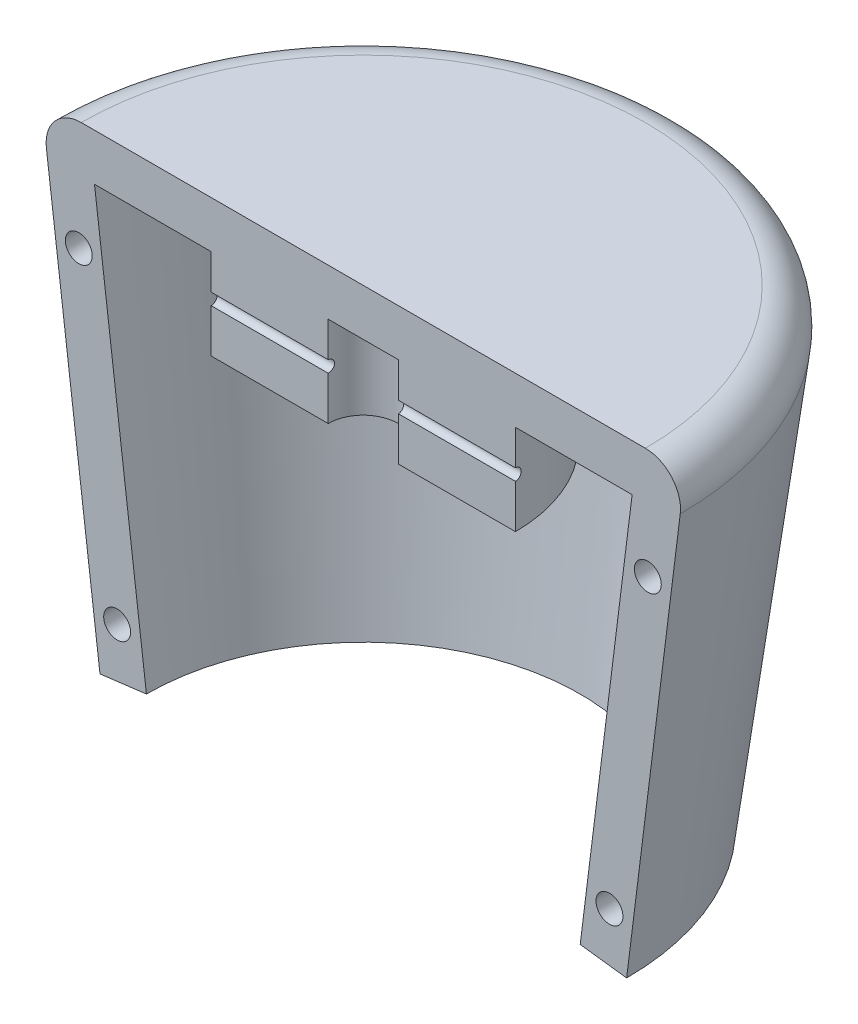
ISO-10303-21;
HEADER;
FILE_DESCRIPTION(('STEP AP214'),'2;1');
FILE_NAME('part.step','',(''),(''),'','','');
FILE_SCHEMA(('AUTOMOTIVE_DESIGN { 1 0 10303 214 1 1 1 1 }'));
ENDSEC;
DATA;
#1=APPLICATION_CONTEXT('core data for automotive mechanical design processes');
#2=APPLICATION_PROTOCOL_DEFINITION('international standard','automotive_design',2000,#1);
#3=PRODUCT_CONTEXT('',#1,'mechanical');
#4=PRODUCT('Part','Part','',(#3));
#5=PRODUCT_RELATED_PRODUCT_CATEGORY('part','',(#4));
#6=PRODUCT_DEFINITION_FORMATION('','',#4);
#7=PRODUCT_DEFINITION_CONTEXT('part definition',#1,'design');
#8=PRODUCT_DEFINITION('design','',#6,#7);
#9=PRODUCT_DEFINITION_SHAPE('','',#8);
#10=(LENGTH_UNIT() NAMED_UNIT(*) SI_UNIT(.MILLI.,.METRE.));
#11=(NAMED_UNIT(*) PLANE_ANGLE_UNIT() SI_UNIT($,.RADIAN.));
#12=(NAMED_UNIT(*) SI_UNIT($,.STERADIAN.) SOLID_ANGLE_UNIT());
#13=UNCERTAINTY_MEASURE_WITH_UNIT(LENGTH_MEASURE(1.E-05),#10,'distance_accuracy_value','');
#14=(GEOMETRIC_REPRESENTATION_CONTEXT(3) GLOBAL_UNCERTAINTY_ASSIGNED_CONTEXT((#13)) GLOBAL_UNIT_ASSIGNED_CONTEXT((#10,
#11,#12)) REPRESENTATION_CONTEXT('',''));
#15=CARTESIAN_POINT('',(0.,0.,0.));
#16=DIRECTION('',(0.,0.,1.));
#17=DIRECTION('',(1.,0.,0.));
#18=AXIS2_PLACEMENT_3D('',#15,#16,#17);
#19=CARTESIAN_POINT('',(0.,40.,0.));
#20=DIRECTION('',(0.,1.,0.));
#21=DIRECTION('',(-1.,0.,0.));
#22=AXIS2_PLACEMENT_3D('',#19,#20,#21);
#23=CYLINDRICAL_SURFACE('',#22,3.);
#24=DIRECTION('',(0.,1.,0.));
#25=VECTOR('',#24,1.);
#26=CARTESIAN_POINT('',(-3.,36.,0.));
#27=LINE('',#26,#25);
#28=CARTESIAN_POINT('',(-3.,33.,0.));
#29=VERTEX_POINT('',#28);
#30=CARTESIAN_POINT('',(-3.,36.,0.));
#31=VERTEX_POINT('',#30);
#32=EDGE_CURVE('E151',#29,#31,#27,.T.);
#33=ORIENTED_EDGE('',*,*,#32,.F.);
#34=CARTESIAN_POINT('',(-3.,33.,0.));
#35=CARTESIAN_POINT('',(-3.0000147639304,33.0000248009824,-0.0279245639136445));
#36=CARTESIAN_POINT('',(-2.99961054875443,32.9976622414982,-0.0558377564918865));
#37=CARTESIAN_POINT('',(-2.99807410355357,32.9883505080388,-0.110832206753165));
#38=CARTESIAN_POINT('',(-2.9969428177627,32.9814072825856,-0.137914495790226));
#39=CARTESIAN_POINT('',(-2.99406131473217,32.9631193253892,-0.190520410616297));
#40=CARTESIAN_POINT('',(-2.99231095459141,32.9517735773517,-0.216043674938698));
#41=CARTESIAN_POINT('',(-2.9883884234628,32.9250188992578,-0.264825281196731));
#42=CARTESIAN_POINT('',(-2.98621624998891,32.9096099452539,-0.288083609782283));
#43=CARTESIAN_POINT('',(-2.98166682330032,32.8750099483992,-0.331893550581972));
#44=CARTESIAN_POINT('',(-2.97928799262738,32.8557880548106,-0.352420637095487));
#45=CARTESIAN_POINT('',(-2.9746054532048,32.8141725142409,-0.389976046582249));
#46=CARTESIAN_POINT('',(-2.97230175642609,32.7917783648384,-0.407003814285053));
#47=CARTESIAN_POINT('',(-2.96801507546756,32.7442851314407,-0.437173866317822));
#48=CARTESIAN_POINT('',(-2.96603414615731,32.7191702914344,-0.450291665381797));
#49=CARTESIAN_POINT('',(-2.96263949656778,32.6670565338948,-0.472112172118848));
#50=CARTESIAN_POINT('',(-2.96122570552704,32.640057851901,-0.48081543062723));
#51=CARTESIAN_POINT('',(-2.95914108655384,32.5852042725034,-0.493482800364945));
#52=CARTESIAN_POINT('',(-2.95846355313407,32.5573595183764,-0.497489710534991));
#53=CARTESIAN_POINT('',(-2.95790787498487,32.5013846162036,-0.500783361656072));
#54=CARTESIAN_POINT('',(-2.95802969270745,32.4732544816248,-0.500070324317516));
#55=CARTESIAN_POINT('',(-2.95905285943334,32.417814339119,-0.493979010226865));
#56=CARTESIAN_POINT('',(-2.95994615267881,32.390498864018,-0.488648942843718));
#57=CARTESIAN_POINT('',(-2.96239900004534,32.3371555707913,-0.473550565119978));
#58=CARTESIAN_POINT('',(-2.96395857277451,32.3111277886513,-0.463782130822525));
#59=CARTESIAN_POINT('',(-2.9675769935558,32.2609537650134,-0.440035229974666));
#60=CARTESIAN_POINT('',(-2.96963821515902,32.23681721166,-0.426036670162596));
#61=CARTESIAN_POINT('',(-2.97402591987438,32.191218323299,-0.394241728150705));
#62=CARTESIAN_POINT('',(-2.97635241452118,32.1697561046624,-0.376445180776667));
#63=CARTESIAN_POINT('',(-2.9810437450182,32.1298375284587,-0.337299196931076));
#64=CARTESIAN_POINT('',(-2.98340870102549,32.1114212894615,-0.315908841019962));
#65=CARTESIAN_POINT('',(-2.98788456267353,32.0784285752277,-0.270313606709418));
#66=CARTESIAN_POINT('',(-2.98999539649458,32.0638531841095,-0.24610793643186));
#67=CARTESIAN_POINT('',(-2.99372931333068,32.0389504033863,-0.19552381086372));
#68=CARTESIAN_POINT('',(-2.99535170568755,32.0286290214337,-0.169142345470613));
#69=CARTESIAN_POINT('',(-2.99791557548819,32.012594314861,-0.115018377774364));
#70=CARTESIAN_POINT('',(-2.99885806696339,32.0068741263644,-0.0872779685237835));
#71=CARTESIAN_POINT('',(-2.99980530629215,32.0011729031573,-0.039594787009645));
#72=CARTESIAN_POINT('',(-3.00000587638439,31.9999891322544,-0.019793444655969));
#73=CARTESIAN_POINT('',(-3.,32.,0.));
#74=B_SPLINE_CURVE_WITH_KNOTS('',3,(#34,#35,#36,#37,#38,#39,#40,#41,#42,#43,#44,#45,#46,#47,#48,
#49,#50,#51,#52,#53,#54,#55,#56,#57,#58,#59,#60,#61,#62,#63,#64,#65,#66,#67,#68,#69,#70,#71,#72,
#73),.UNSPECIFIED.,.F.,.F.,(4,2,2,2,2,2,2,2,2,2,2,2,2,2,2,2,2,2,2,4),(0.,0.083653964100156,
0.167199507173348,0.250764347685629,0.334329680719544,0.418600958696159,0.502885598496283,
0.587687467227782,0.672478751990046,0.756491152577018,0.840499606871928,0.923641306490468,
1.00678532827338,1.09033066685202,1.17387963955236,1.25845388716987,1.34305198121945,
1.42776914147558,1.51235968845851,1.57172612554727),.UNSPECIFIED.);
#75=CARTESIAN_POINT('',(-3.,32.,0.));
#76=VERTEX_POINT('',#75);
#77=EDGE_CURVE('E139',#29,#76,#74,.T.);
#78=ORIENTED_EDGE('',*,*,#77,.T.);
#79=CARTESIAN_POINT('',(-3.,28.277027027027,0.));
#80=VERTEX_POINT('',#79);
#81=EDGE_CURVE('E149',#80,#76,#27,.T.);
#82=ORIENTED_EDGE('',*,*,#81,.F.);
#83=CARTESIAN_POINT('',(0.,28.277027027027,0.));
#84=DIRECTION('',(0.,1.,0.));
#85=DIRECTION('',(-1.,0.,0.));
#86=AXIS2_PLACEMENT_3D('',#83,#84,#85);
#87=CIRCLE('',#86,3.);
#88=CARTESIAN_POINT('',(3.,28.277027027027,0.));
#89=VERTEX_POINT('',#88);
#90=EDGE_CURVE('E219',#89,#80,#87,.T.);
#91=ORIENTED_EDGE('',*,*,#90,.F.);
#92=DIRECTION('',(0.,1.,0.));
#93=VECTOR('',#92,1.);
#94=CARTESIAN_POINT('',(3.,36.,0.));
#95=LINE('',#94,#93);
#96=CARTESIAN_POINT('',(3.,32.,0.));
#97=VERTEX_POINT('',#96);
#98=EDGE_CURVE('E194',#89,#97,#95,.T.);
#99=ORIENTED_EDGE('',*,*,#98,.T.);
#100=CARTESIAN_POINT('',(3.,32.,0.));
#101=CARTESIAN_POINT('',(3.0000147639304,31.9999751990176,-0.0279245639136241));
#102=CARTESIAN_POINT('',(2.99961054875443,32.0023377585018,-0.0558377564918663));
#103=CARTESIAN_POINT('',(2.99807410355357,32.0116494919612,-0.110832206753146));
#104=CARTESIAN_POINT('',(2.99694281776271,32.0185927174144,-0.137914495790207));
#105=CARTESIAN_POINT('',(2.99406131473217,32.0368806746108,-0.190520410616279));
#106=CARTESIAN_POINT('',(2.99231095459141,32.0482264226483,-0.216043674938679));
#107=CARTESIAN_POINT('',(2.98838842346281,32.0749811007422,-0.264825281196716));
#108=CARTESIAN_POINT('',(2.98621624998892,32.0903900547461,-0.288083609782271));
#109=CARTESIAN_POINT('',(2.98166682330033,32.1249900516008,-0.331893550581961));
#110=CARTESIAN_POINT('',(2.97928799262738,32.1442119451894,-0.352420637095474));
#111=CARTESIAN_POINT('',(2.9746054532048,32.1858274857591,-0.389976046582236));
#112=CARTESIAN_POINT('',(2.97230175642609,32.2082216351616,-0.407003814285042));
#113=CARTESIAN_POINT('',(2.96801507546756,32.2557148685593,-0.437173866317814));
#114=CARTESIAN_POINT('',(2.96603414615731,32.2808297085656,-0.450291665381789));
#115=CARTESIAN_POINT('',(2.96263949656779,32.3329434661052,-0.472112172118842));
#116=CARTESIAN_POINT('',(2.96122570552704,32.3599421480989,-0.480815430627225));
#117=CARTESIAN_POINT('',(2.95914108655384,32.4147957274966,-0.493482800364942));
#118=CARTESIAN_POINT('',(2.95846355313408,32.4426404816235,-0.497489710534988));
#119=CARTESIAN_POINT('',(2.95790787498487,32.4986153837964,-0.500783361656072));
#120=CARTESIAN_POINT('',(2.95802969270746,32.5267455183752,-0.500070324317517));
#121=CARTESIAN_POINT('',(2.95905285943334,32.582185660881,-0.493979010226869));
#122=CARTESIAN_POINT('',(2.95994615267881,32.609501135982,-0.488648942843724));
#123=CARTESIAN_POINT('',(2.96239900004534,32.6628444292087,-0.473550565119986));
#124=CARTESIAN_POINT('',(2.96395857277451,32.6888722113487,-0.463782130822533));
#125=CARTESIAN_POINT('',(2.96757699355581,32.7390462349866,-0.440035229974674));
#126=CARTESIAN_POINT('',(2.96963821515902,32.76318278834,-0.426036670162605));
#127=CARTESIAN_POINT('',(2.97402591987438,32.808781676701,-0.394241728150716));
#128=CARTESIAN_POINT('',(2.97635241452118,32.8302438953376,-0.376445180776679));
#129=CARTESIAN_POINT('',(2.9810437450182,32.8701624715412,-0.33729919693109));
#130=CARTESIAN_POINT('',(2.98340870102549,32.8885787105385,-0.315908841019978));
#131=CARTESIAN_POINT('',(2.98788456267353,32.9215714247723,-0.270313606709434));
#132=CARTESIAN_POINT('',(2.98999539649458,32.9361468158905,-0.246107936431875));
#133=CARTESIAN_POINT('',(2.99372931333068,32.9610495966137,-0.195523810863735));
#134=CARTESIAN_POINT('',(2.99535170568755,32.9713709785663,-0.16914234547063));
#135=CARTESIAN_POINT('',(2.99791557548819,32.987405685139,-0.115018377774382));
#136=CARTESIAN_POINT('',(2.99885806696339,32.9931258736356,-0.0872779685238021));
#137=CARTESIAN_POINT('',(2.99980530629215,32.9988270968427,-0.039594787009651));
#138=CARTESIAN_POINT('',(3.0000058763844,33.0000108677456,-0.019793444655962));
#139=CARTESIAN_POINT('',(3.,33.,0.));
#140=B_SPLINE_CURVE_WITH_KNOTS('',3,(#100,#101,#102,#103,#104,#105,#106,#107,#108,#109,#110,
#111,#112,#113,#114,#115,#116,#117,#118,#119,#120,#121,#122,#123,#124,#125,#126,#127,#128,#129,
#130,#131,#132,#133,#134,#135,#136,#137,#138,#139),.UNSPECIFIED.,.F.,.F.,(4,2,2,2,2,2,2,2,2,2,2,
2,2,2,2,2,2,2,2,4),(0.,0.0836539641001557,0.167199507173349,0.250764347685631,0.334329680719548,
0.418600958696167,0.502885598496286,0.587687467227787,0.672478751990045,0.756491152577018,
0.840499606871927,0.92364130649046,1.00678532827338,1.09033066685202,1.17387963955236,
1.25845388716987,1.34305198121945,1.42776914147558,1.51235968845851,1.57172612554731),.UNSPECIFIED.);
#141=CARTESIAN_POINT('',(3.,33.,0.));
#142=VERTEX_POINT('',#141);
#143=EDGE_CURVE('E59',#97,#142,#140,.T.);
#144=ORIENTED_EDGE('',*,*,#143,.T.);
#145=CARTESIAN_POINT('',(3.,36.,0.));
#146=VERTEX_POINT('',#145);
#147=EDGE_CURVE('E193',#142,#146,#95,.T.);
#148=ORIENTED_EDGE('',*,*,#147,.T.);
#149=CARTESIAN_POINT('',(0.,36.,0.));
#150=DIRECTION('',(0.,1.,0.));
#151=DIRECTION('',(-1.,0.,0.));
#152=AXIS2_PLACEMENT_3D('',#149,#150,#151);
#153=CIRCLE('',#152,3.);
#154=EDGE_CURVE('E222',#146,#31,#153,.T.);
#155=ORIENTED_EDGE('',*,*,#154,.T.);
#156=EDGE_LOOP('',(#33,#78,#82,#91,#99,#144,#148,#155));
#157=FACE_BOUND('',#156,.T.);
#158=ADVANCED_FACE('F43',(#157),#23,.F.);
#159=CARTESIAN_POINT('',(0.,40.,0.));
#160=DIRECTION('',(0.,1.,0.));
#161=DIRECTION('',(-1.,0.,0.));
#162=AXIS2_PLACEMENT_3D('',#159,#160,#161);
#163=CYLINDRICAL_SURFACE('',#162,13.);
#164=DIRECTION('',(0.,-1.,0.));
#165=VECTOR('',#164,1.);
#166=CARTESIAN_POINT('',(-13.,28.277027027027,0.));
#167=LINE('',#166,#165);
#168=CARTESIAN_POINT('',(-13.,32.,0.));
#169=VERTEX_POINT('',#168);
#170=CARTESIAN_POINT('',(-13.,28.277027027027,0.));
#171=VERTEX_POINT('',#170);
#172=EDGE_CURVE('E273',#169,#171,#167,.T.);
#173=ORIENTED_EDGE('',*,*,#172,.F.);
#174=CARTESIAN_POINT('',(-13.,32.,0.));
#175=CARTESIAN_POINT('',(-13.0000035132119,31.9999760642147,-0.0281174552121379));
#176=CARTESIAN_POINT('',(-12.9999088766393,32.0023703375464,-0.0562275432370705));
#177=CARTESIAN_POINT('',(-12.9995492608419,32.0118186194758,-0.111631319852076));
#178=CARTESIAN_POINT('',(-12.9992844115316,32.0188690743658,-0.138925614481822));
#179=CARTESIAN_POINT('',(-12.9986101016094,32.0374577240236,-0.191953351720072));
#180=CARTESIAN_POINT('',(-12.9982005757836,32.048997942816,-0.21768608430616));
#181=CARTESIAN_POINT('',(-12.9972842239831,32.0762278173729,-0.266844646969351));
#182=CARTESIAN_POINT('',(-12.9967774160351,32.091916704573,-0.29027090323226));
#183=CARTESIAN_POINT('',(-12.9957229355148,32.1270106201056,-0.334169226927111));
#184=CARTESIAN_POINT('',(-12.995175243362,32.1464174361039,-0.354639864892575));
#185=CARTESIAN_POINT('',(-12.9941008987482,32.1883950786375,-0.392036510430603));
#186=CARTESIAN_POINT('',(-12.9935742495031,32.210966386449,-0.408961977852564));
#187=CARTESIAN_POINT('',(-12.9926013007152,32.2586377931233,-0.438788146729855));
#188=CARTESIAN_POINT('',(-12.9921550226534,32.283738565257,-0.45168777285846));
#189=CARTESIAN_POINT('',(-12.9913934069437,32.3357499474249,-0.473088420619371));
#190=CARTESIAN_POINT('',(-12.9910780605221,32.36266043605,-0.481589736990493));
#191=CARTESIAN_POINT('',(-12.9906140090866,32.4175150872946,-0.493949703342922));
#192=CARTESIAN_POINT('',(-12.9904652240381,32.4454587467901,-0.497810583171391));
#193=CARTESIAN_POINT('',(-12.9903508317234,32.5015986232511,-0.500786972369972));
#194=CARTESIAN_POINT('',(-12.9903852280009,32.5297948450921,-0.499902389934902));
#195=CARTESIAN_POINT('',(-12.9906332513038,32.5856227529954,-0.493414668348014));
#196=CARTESIAN_POINT('',(-12.9908467814915,32.6132547358132,-0.487814078606448));
#197=CARTESIAN_POINT('',(-12.991428849319,32.6671859075582,-0.47205729066416));
#198=CARTESIAN_POINT('',(-12.9917973867406,32.6934850983608,-0.461901098873533));
#199=CARTESIAN_POINT('',(-12.9926480489076,32.7440130144111,-0.437318229985122));
#200=CARTESIAN_POINT('',(-12.9931302070657,32.7682411277506,-0.422890296365473));
#201=CARTESIAN_POINT('',(-12.9941536930643,32.8139311015788,-0.390175196322433));
#202=CARTESIAN_POINT('',(-12.9946950182886,32.8353930842871,-0.371888200503441));
#203=CARTESIAN_POINT('',(-12.9957762040031,32.8749549696929,-0.331962381978058));
#204=CARTESIAN_POINT('',(-12.996316063596,32.8930531363028,-0.310321838990642));
#205=CARTESIAN_POINT('',(-12.9973333289028,32.9253653024465,-0.264300871222812));
#206=CARTESIAN_POINT('',(-12.9978107148502,32.9395780741836,-0.239919583785663));
#207=CARTESIAN_POINT('',(-12.9986494541208,32.9637166267974,-0.18910102659219));
#208=CARTESIAN_POINT('',(-12.9990107350529,32.9736397344073,-0.162662486854808));
#209=CARTESIAN_POINT('',(-12.9995749374342,32.9888866070271,-0.108525730018713));
#210=CARTESIAN_POINT('',(-12.999778100346,32.9942173863339,-0.0808295022723348));
#211=CARTESIAN_POINT('',(-12.9999642771233,32.9990667158957,-0.0353239786092012));
#212=CARTESIAN_POINT('',(-13.000000993749,33.0000076288249,-0.0176573871833034));
#213=CARTESIAN_POINT('',(-13.,33.,0.));
#214=B_SPLINE_CURVE_WITH_KNOTS('',3,(#174,#175,#176,#177,#178,#179,#180,#181,#182,#183,#184,
#185,#186,#187,#188,#189,#190,#191,#192,#193,#194,#195,#196,#197,#198,#199,#200,#201,#202,#203,
#204,#205,#206,#207,#208,#209,#210,#211,#212,#213),.UNSPECIFIED.,.F.,.F.,(4,2,2,2,2,2,2,2,2,2,2,
2,2,2,2,2,2,2,2,4),(0.,0.0842398560442666,0.168415492431489,0.252629119981758,0.336827157397276,
0.421065781236175,0.505317230550608,0.589591164717802,0.67385945080215,0.758087227633119,
0.842316633931098,0.926500536152512,1.01068431992086,1.09489289077559,1.17909773965249,
1.26334592725551,1.34762070684717,1.43194793001396,1.51614612271676,1.56911768803553),.UNSPECIFIED.);
#215=CARTESIAN_POINT('',(-13.,33.,0.));
#216=VERTEX_POINT('',#215);
#217=EDGE_CURVE('E67',#169,#216,#214,.T.);
#218=ORIENTED_EDGE('',*,*,#217,.T.);
#219=CARTESIAN_POINT('',(-13.,36.,0.));
#220=VERTEX_POINT('',#219);
#221=EDGE_CURVE('E274',#220,#216,#167,.T.);
#222=ORIENTED_EDGE('',*,*,#221,.F.);
#223=CARTESIAN_POINT('',(0.,36.,0.));
#224=DIRECTION('',(0.,1.,0.));
#225=DIRECTION('',(-1.,0.,0.));
#226=AXIS2_PLACEMENT_3D('',#223,#224,#225);
#227=CIRCLE('',#226,13.);
#228=CARTESIAN_POINT('',(13.,36.,0.));
#229=VERTEX_POINT('',#228);
#230=EDGE_CURVE('E212',#229,#220,#227,.T.);
#231=ORIENTED_EDGE('',*,*,#230,.F.);
#232=DIRECTION('',(0.,-1.,0.));
#233=VECTOR('',#232,1.);
#234=CARTESIAN_POINT('',(13.,28.277027027027,0.));
#235=LINE('',#234,#233);
#236=CARTESIAN_POINT('',(13.,33.,0.));
#237=VERTEX_POINT('',#236);
#238=EDGE_CURVE('E185',#229,#237,#235,.T.);
#239=ORIENTED_EDGE('',*,*,#238,.T.);
#240=CARTESIAN_POINT('',(13.,33.,0.));
#241=CARTESIAN_POINT('',(13.0000035132119,33.0000239357853,-0.0281174552120494));
#242=CARTESIAN_POINT('',(12.9999088766393,32.9976296624536,-0.0562275432369822));
#243=CARTESIAN_POINT('',(12.9995492608419,32.9881813805242,-0.11163131985199));
#244=CARTESIAN_POINT('',(12.9992844115316,32.9811309256342,-0.138925614481738));
#245=CARTESIAN_POINT('',(12.9986101016094,32.9625422759765,-0.191953351719992));
#246=CARTESIAN_POINT('',(12.9982005757836,32.951002057184,-0.217686084306081));
#247=CARTESIAN_POINT('',(12.9972842239831,32.9237721826272,-0.266844646969277));
#248=CARTESIAN_POINT('',(12.9967774160351,32.9080832954271,-0.29027090323219));
#249=CARTESIAN_POINT('',(12.9957229355148,32.8729893798944,-0.334169226927047));
#250=CARTESIAN_POINT('',(12.9951752433621,32.8535825638962,-0.354639864892515));
#251=CARTESIAN_POINT('',(12.9941008987482,32.8116049213626,-0.39203651043055));
#252=CARTESIAN_POINT('',(12.9935742495032,32.7890336135511,-0.408961977852516));
#253=CARTESIAN_POINT('',(12.9926013007152,32.7413622068768,-0.438788146729814));
#254=CARTESIAN_POINT('',(12.9921550226534,32.7162614347431,-0.451687772858422));
#255=CARTESIAN_POINT('',(12.9913934069437,32.6642500525752,-0.473088420619342));
#256=CARTESIAN_POINT('',(12.9910780605221,32.6373395639501,-0.481589736990469));
#257=CARTESIAN_POINT('',(12.9906140090866,32.5824849127054,-0.493949703342907));
#258=CARTESIAN_POINT('',(12.9904652240381,32.55454125321,-0.497810583171381));
#259=CARTESIAN_POINT('',(12.9903508317234,32.498401376749,-0.500786972369972));
#260=CARTESIAN_POINT('',(12.9903852280009,32.470205154908,-0.499902389934907));
#261=CARTESIAN_POINT('',(12.9906332513038,32.4143772470046,-0.493414668348027));
#262=CARTESIAN_POINT('',(12.9908467814915,32.3867452641869,-0.487814078606465));
#263=CARTESIAN_POINT('',(12.991428849319,32.3328140924419,-0.472057290664185));
#264=CARTESIAN_POINT('',(12.9917973867406,32.3065149016393,-0.461901098873561));
#265=CARTESIAN_POINT('',(12.9926480489076,32.2559869855889,-0.43731822998516));
#266=CARTESIAN_POINT('',(12.9931302070657,32.2317588722494,-0.422890296365515));
#267=CARTESIAN_POINT('',(12.9941536930643,32.1860688984213,-0.390175196322485));
#268=CARTESIAN_POINT('',(12.9946950182886,32.1646069157129,-0.371888200503498));
#269=CARTESIAN_POINT('',(12.9957762040031,32.1250450303071,-0.331962381978125));
#270=CARTESIAN_POINT('',(12.996316063596,32.1069468636972,-0.310321838990712));
#271=CARTESIAN_POINT('',(12.9973333289028,32.0746346975536,-0.264300871222888));
#272=CARTESIAN_POINT('',(12.9978107148502,32.0604219258164,-0.239919583785742));
#273=CARTESIAN_POINT('',(12.9986494541208,32.0362833732027,-0.189101026592275));
#274=CARTESIAN_POINT('',(12.9990107350529,32.0263602655928,-0.162662486854895));
#275=CARTESIAN_POINT('',(12.9995749374342,32.0111133929729,-0.108525730018801));
#276=CARTESIAN_POINT('',(12.999778100346,32.0057826136661,-0.0808295022724227));
#277=CARTESIAN_POINT('',(12.9999642771233,32.0009332841043,-0.0353239786092301));
#278=CARTESIAN_POINT('',(13.000000993749,31.9999923711751,-0.0176573871832733));
#279=CARTESIAN_POINT('',(13.,32.,0.));
#280=B_SPLINE_CURVE_WITH_KNOTS('',3,(#240,#241,#242,#243,#244,#245,#246,#247,#248,#249,#250,
#251,#252,#253,#254,#255,#256,#257,#258,#259,#260,#261,#262,#263,#264,#265,#266,#267,#268,#269,
#270,#271,#272,#273,#274,#275,#276,#277,#278,#279),.UNSPECIFIED.,.F.,.F.,(4,2,2,2,2,2,2,2,2,2,2,
2,2,2,2,2,2,2,2,4),(0.,0.084239856044266,0.168415492431491,0.252629119981759,0.336827157397276,
0.421065781236179,0.505317230550614,0.589591164717799,0.673859450802153,0.758087227633117,
0.842316633931109,0.926500536152527,1.01068431992087,1.0948928907756,1.17909773965249,
1.26334592725551,1.34762070684716,1.43194793001395,1.51614612271676,1.5691176880357),.UNSPECIFIED.);
#281=CARTESIAN_POINT('',(13.,32.,0.));
#282=VERTEX_POINT('',#281);
#283=EDGE_CURVE('E153',#237,#282,#280,.T.);
#284=ORIENTED_EDGE('',*,*,#283,.T.);
#285=CARTESIAN_POINT('',(13.,28.277027027027,0.));
#286=VERTEX_POINT('',#285);
#287=EDGE_CURVE('E184',#282,#286,#235,.T.);
#288=ORIENTED_EDGE('',*,*,#287,.T.);
#289=CARTESIAN_POINT('',(0.,28.277027027027,0.));
#290=DIRECTION('',(0.,1.,0.));
#291=DIRECTION('',(-1.,0.,0.));
#292=AXIS2_PLACEMENT_3D('',#289,#290,#291);
#293=CIRCLE('',#292,13.);
#294=EDGE_CURVE('E215',#286,#171,#293,.T.);
#295=ORIENTED_EDGE('',*,*,#294,.T.);
#296=EDGE_LOOP('',(#173,#218,#222,#231,#239,#284,#288,#295));
#297=FACE_BOUND('',#296,.T.);
#298=ADVANCED_FACE('F281',(#297),#163,.T.);
#299=CARTESIAN_POINT('',(0.,0.,0.));
#300=DIRECTION('',(0.,0.,1.));
#301=DIRECTION('',(1.,0.,0.));
#302=AXIS2_PLACEMENT_3D('',#299,#300,#301);
#303=PLANE('',#302);
#304=CARTESIAN_POINT('',(-24.3097436392452,30.6024646105589,0.));
#305=DIRECTION('',(0.,0.,1.));
#306=DIRECTION('',(1.,0.,0.));
#307=AXIS2_PLACEMENT_3D('',#304,#305,#306);
#308=CIRCLE('',#307,1.15);
#309=CARTESIAN_POINT('',(-23.1597436392452,30.6024646105589,0.));
#310=VERTEX_POINT('',#309);
#311=EDGE_CURVE('E380',#310,#310,#308,.T.);
#312=ORIENTED_EDGE('',*,*,#311,.F.);
#313=EDGE_LOOP('',(#312));
#314=FACE_BOUND('',#313,.T.);
#315=CARTESIAN_POINT('',(-21.0338343231322,4.39519008165474,0.));
#316=DIRECTION('',(0.,0.,1.));
#317=DIRECTION('',(1.,0.,0.));
#318=AXIS2_PLACEMENT_3D('',#315,#316,#317);
#319=CIRCLE('',#318,1.15);
#320=CARTESIAN_POINT('',(-19.8838343231322,4.39519008165474,0.));
#321=VERTEX_POINT('',#320);
#322=EDGE_CURVE('E376',#321,#321,#319,.T.);
#323=ORIENTED_EDGE('',*,*,#322,.F.);
#324=EDGE_LOOP('',(#323));
#325=FACE_BOUND('',#324,.T.);
#326=CARTESIAN_POINT('',(21.0338343231322,4.39519008165474,0.));
#327=DIRECTION('',(0.,0.,1.));
#328=DIRECTION('',(1.,0.,0.));
#329=AXIS2_PLACEMENT_3D('',#326,#327,#328);
#330=CIRCLE('',#329,1.15);
#331=CARTESIAN_POINT('',(22.1838343231322,4.39519008165474,0.));
#332=VERTEX_POINT('',#331);
#333=EDGE_CURVE('E368',#332,#332,#330,.T.);
#334=ORIENTED_EDGE('',*,*,#333,.F.);
#335=EDGE_LOOP('',(#334));
#336=FACE_BOUND('',#335,.T.);
#337=CARTESIAN_POINT('',(24.3097436392452,30.6024646105589,0.));
#338=DIRECTION('',(0.,0.,1.));
#339=DIRECTION('',(1.,0.,0.));
#340=AXIS2_PLACEMENT_3D('',#337,#338,#339);
#341=CIRCLE('',#340,1.15);
#342=CARTESIAN_POINT('',(25.4597436392452,30.6024646105589,0.));
#343=VERTEX_POINT('',#342);
#344=EDGE_CURVE('E360',#343,#343,#341,.T.);
#345=ORIENTED_EDGE('',*,*,#344,.F.);
#346=EDGE_LOOP('',(#345));
#347=FACE_BOUND('',#346,.T.);
#348=ORIENTED_EDGE('',*,*,#221,.T.);
#349=DIRECTION('',(-1.,0.,0.));
#350=VECTOR('',#349,1.);
#351=CARTESIAN_POINT('',(-14.,33.,0.));
#352=LINE('',#351,#350);
#353=EDGE_CURVE('E11',#216,#29,#352,.F.);
#354=ORIENTED_EDGE('',*,*,#353,.T.);
#355=ORIENTED_EDGE('',*,*,#32,.T.);
#356=DIRECTION('',(-1.,0.,0.));
#357=VECTOR('',#356,1.);
#358=CARTESIAN_POINT('',(0.,36.,0.));
#359=LINE('',#358,#357);
#360=EDGE_CURVE('E198',#146,#31,#359,.T.);
#361=ORIENTED_EDGE('',*,*,#360,.F.);
#362=ORIENTED_EDGE('',*,*,#147,.F.);
#363=EDGE_CURVE('E47',#142,#237,#352,.F.);
#364=ORIENTED_EDGE('',*,*,#363,.T.);
#365=ORIENTED_EDGE('',*,*,#238,.F.);
#366=DIRECTION('',(-1.,0.,0.));
#367=VECTOR('',#366,1.);
#368=CARTESIAN_POINT('',(13.,36.,0.));
#369=LINE('',#368,#367);
#370=CARTESIAN_POINT('',(22.9688711258507,36.,1.60390769820401E-13));
#371=VERTEX_POINT('',#370);
#372=EDGE_CURVE('E180',#371,#229,#369,.T.);
#373=ORIENTED_EDGE('',*,*,#372,.F.);
#374=DIRECTION('',(0.124034734589208,0.992277876713668,0.));
#375=VECTOR('',#374,1.);
#376=CARTESIAN_POINT('',(22.9688711258507,36.,1.60390769820401E-13));
#377=LINE('',#376,#375);
#378=CARTESIAN_POINT('',(18.5308884931453,0.496138938356831,1.29400502732E-13));
#379=VERTEX_POINT('',#378);
#380=EDGE_CURVE('E176',#379,#371,#377,.T.);
#381=ORIENTED_EDGE('',*,*,#380,.F.);
#382=DIRECTION('',(-0.992277876713668,0.124034734589207,0.));
#383=VECTOR('',#382,1.);
#384=CARTESIAN_POINT('',(22.5,0.,1.57116660247941E-13));
#385=LINE('',#384,#383);
#386=CARTESIAN_POINT('',(22.5,0.,1.57116660247941E-13));
#387=VERTEX_POINT('',#386);
#388=EDGE_CURVE('E172',#387,#379,#385,.T.);
#389=ORIENTED_EDGE('',*,*,#388,.F.);
#390=DIRECTION('',(-0.124034734589208,-0.992277876713668,0.));
#391=VECTOR('',#390,1.);
#392=CARTESIAN_POINT('',(27.5,40.,1.92031473636372E-13));
#393=LINE('',#392,#391);
#394=CARTESIAN_POINT('',(27.078486974529,36.6278957962324,1.8908806391135E-13));
#395=VERTEX_POINT('',#394);
#396=EDGE_CURVE('E165',#395,#387,#393,.T.);
#397=ORIENTED_EDGE('',*,*,#396,.F.);
#398=CARTESIAN_POINT('',(24.101653344388,37.,1.68300945774394E-13));
#399=DIRECTION('',(0.,0.,1.));
#400=DIRECTION('',(1.,0.,0.));
#401=AXIS2_PLACEMENT_3D('',#398,#399,#400);
#402=CIRCLE('',#401,3.);
#403=CARTESIAN_POINT('',(24.101653344388,40.,1.68300945774394E-13));
#404=VERTEX_POINT('',#403);
#405=EDGE_CURVE('E229',#395,#404,#402,.T.);
#406=ORIENTED_EDGE('',*,*,#405,.T.);
#407=DIRECTION('',(1.,0.,0.));
#408=VECTOR('',#407,1.);
#409=CARTESIAN_POINT('',(0.,40.,0.));
#410=LINE('',#409,#408);
#411=CARTESIAN_POINT('',(-24.101653344388,40.,-1.68300945774394E-13));
#412=VERTEX_POINT('',#411);
#413=EDGE_CURVE('E160',#412,#404,#410,.T.);
#414=ORIENTED_EDGE('',*,*,#413,.F.);
#415=CARTESIAN_POINT('',(-24.101653344388,37.,-1.68300945774394E-13));
#416=DIRECTION('',(0.,0.,1.));
#417=DIRECTION('',(1.,0.,0.));
#418=AXIS2_PLACEMENT_3D('',#415,#416,#417);
#419=CIRCLE('',#418,3.);
#420=CARTESIAN_POINT('',(-27.078486974529,36.6278957962324,0.));
#421=VERTEX_POINT('',#420);
#422=EDGE_CURVE('E232',#412,#421,#419,.T.);
#423=ORIENTED_EDGE('',*,*,#422,.T.);
#424=DIRECTION('',(0.124034734589208,-0.992277876713668,0.));
#425=VECTOR('',#424,1.);
#426=CARTESIAN_POINT('',(-27.5,40.,0.));
#427=LINE('',#426,#425);
#428=CARTESIAN_POINT('',(-22.5,0.,0.));
#429=VERTEX_POINT('',#428);
#430=EDGE_CURVE('E242',#421,#429,#427,.T.);
#431=ORIENTED_EDGE('',*,*,#430,.T.);
#432=DIRECTION('',(0.992277876713668,0.124034734589207,0.));
#433=VECTOR('',#432,1.);
#434=CARTESIAN_POINT('',(-22.5,0.,0.));
#435=LINE('',#434,#433);
#436=CARTESIAN_POINT('',(-18.5308884931453,0.496138938356827,0.));
#437=VERTEX_POINT('',#436);
#438=EDGE_CURVE('E257',#429,#437,#435,.T.);
#439=ORIENTED_EDGE('',*,*,#438,.T.);
#440=DIRECTION('',(-0.124034734589209,0.992277876713668,0.));
#441=VECTOR('',#440,1.);
#442=CARTESIAN_POINT('',(-22.9688711258507,36.,0.));
#443=LINE('',#442,#441);
#444=CARTESIAN_POINT('',(-22.9688711258507,36.,0.));
#445=VERTEX_POINT('',#444);
#446=EDGE_CURVE('E264',#437,#445,#443,.T.);
#447=ORIENTED_EDGE('',*,*,#446,.T.);
#448=DIRECTION('',(1.,0.,0.));
#449=VECTOR('',#448,1.);
#450=CARTESIAN_POINT('',(-13.,36.,0.));
#451=LINE('',#450,#449);
#452=EDGE_CURVE('E267',#445,#220,#451,.T.);
#453=ORIENTED_EDGE('',*,*,#452,.T.);
#454=EDGE_LOOP('',(#348,#354,#355,#361,#362,#364,#365,#373,#381,#389,#397,#406,#414,#423,#431,
#439,#447,#453));
#455=FACE_BOUND('',#454,.T.);
#456=ADVANCED_FACE('F248',(#314,#325,#336,#347,#455),#303,.T.);
#457=ORIENTED_EDGE('',*,*,#287,.F.);
#458=DIRECTION('',(-1.,0.,0.));
#459=VECTOR('',#458,1.);
#460=CARTESIAN_POINT('',(-14.,32.,0.));
#461=LINE('',#460,#459);
#462=EDGE_CURVE('E144',#282,#97,#461,.T.);
#463=ORIENTED_EDGE('',*,*,#462,.T.);
#464=ORIENTED_EDGE('',*,*,#98,.F.);
#465=DIRECTION('',(-1.,0.,0.));
#466=VECTOR('',#465,1.);
#467=CARTESIAN_POINT('',(3.,28.277027027027,0.));
#468=LINE('',#467,#466);
#469=EDGE_CURVE('E189',#286,#89,#468,.T.);
#470=ORIENTED_EDGE('',*,*,#469,.F.);
#471=EDGE_LOOP('',(#457,#463,#464,#470));
#472=FACE_BOUND('',#471,.T.);
#473=ADVANCED_FACE('F290',(#472),#303,.T.);
#474=ORIENTED_EDGE('',*,*,#81,.T.);
#475=EDGE_CURVE('E136',#76,#169,#461,.T.);
#476=ORIENTED_EDGE('',*,*,#475,.T.);
#477=ORIENTED_EDGE('',*,*,#172,.T.);
#478=DIRECTION('',(1.,0.,0.));
#479=VECTOR('',#478,1.);
#480=CARTESIAN_POINT('',(-3.,28.277027027027,0.));
#481=LINE('',#480,#479);
#482=EDGE_CURVE('E158',#171,#80,#481,.T.);
#483=ORIENTED_EDGE('',*,*,#482,.T.);
#484=EDGE_LOOP('',(#474,#476,#477,#483));
#485=FACE_BOUND('',#484,.T.);
#486=ADVANCED_FACE('F156',(#485),#303,.T.);
#487=CARTESIAN_POINT('',(0.,36.,0.));
#488=DIRECTION('',(0.,-1.,0.));
#489=DIRECTION('',(1.,0.,0.));
#490=AXIS2_PLACEMENT_3D('',#487,#488,#489);
#491=PLANE('',#490);
#492=ORIENTED_EDGE('',*,*,#154,.F.);
#493=ORIENTED_EDGE('',*,*,#360,.T.);
#494=EDGE_LOOP('',(#492,#493));
#495=FACE_BOUND('',#494,.T.);
#496=ADVANCED_FACE('F318',(#495),#491,.T.);
#497=CARTESIAN_POINT('',(3.,28.277027027027,0.));
#498=DIRECTION('',(0.,-1.,0.));
#499=DIRECTION('',(1.,0.,0.));
#500=AXIS2_PLACEMENT_3D('',#497,#498,#499);
#501=PLANE('',#500);
#502=ORIENTED_EDGE('',*,*,#294,.F.);
#503=ORIENTED_EDGE('',*,*,#469,.T.);
#504=ORIENTED_EDGE('',*,*,#90,.T.);
#505=ORIENTED_EDGE('',*,*,#482,.F.);
#506=EDGE_LOOP('',(#502,#503,#504,#505));
#507=FACE_BOUND('',#506,.T.);
#508=ADVANCED_FACE('F286',(#507),#501,.T.);
#509=CARTESIAN_POINT('',(13.,36.,0.));
#510=DIRECTION('',(0.,-1.,0.));
#511=DIRECTION('',(1.,0.,0.));
#512=AXIS2_PLACEMENT_3D('',#509,#510,#511);
#513=PLANE('',#512);
#514=CARTESIAN_POINT('',(0.,36.,0.));
#515=DIRECTION('',(0.,1.,0.));
#516=DIRECTION('',(-1.,0.,0.));
#517=AXIS2_PLACEMENT_3D('',#514,#515,#516);
#518=CIRCLE('',#517,22.9688711258507);
#519=EDGE_CURVE('E209',#371,#445,#518,.T.);
#520=ORIENTED_EDGE('',*,*,#519,.F.);
#521=ORIENTED_EDGE('',*,*,#372,.T.);
#522=ORIENTED_EDGE('',*,*,#230,.T.);
#523=ORIENTED_EDGE('',*,*,#452,.F.);
#524=EDGE_LOOP('',(#520,#521,#522,#523));
#525=FACE_BOUND('',#524,.T.);
#526=ADVANCED_FACE('F299',(#525),#513,.T.);
#527=CARTESIAN_POINT('',(0.,0.49613893835683,0.));
#528=DIRECTION('',(0.,1.,0.));
#529=DIRECTION('',(-1.,0.,0.));
#530=AXIS2_PLACEMENT_3D('',#527,#528,#529);
#531=CONICAL_SURFACE('',#530,18.5308884931453,0.124354994546761);
#532=CARTESIAN_POINT('',(0.,0.49613893835683,0.));
#533=DIRECTION('',(0.,1.,0.));
#534=DIRECTION('',(-1.,0.,0.));
#535=AXIS2_PLACEMENT_3D('',#532,#533,#534);
#536=CIRCLE('',#535,18.5308884931453);
#537=EDGE_CURVE('E206',#379,#437,#536,.T.);
#538=ORIENTED_EDGE('',*,*,#537,.F.);
#539=ORIENTED_EDGE('',*,*,#380,.T.);
#540=ORIENTED_EDGE('',*,*,#519,.T.);
#541=ORIENTED_EDGE('',*,*,#446,.F.);
#542=EDGE_LOOP('',(#538,#539,#540,#541));
#543=FACE_BOUND('',#542,.T.);
#544=ADVANCED_FACE('F301',(#543),#531,.F.);
#545=CARTESIAN_POINT('',(0.,0.,0.));
#546=DIRECTION('',(0.,-1.,0.));
#547=DIRECTION('',(1.,0.,0.));
#548=AXIS2_PLACEMENT_3D('',#545,#546,#547);
#549=CONICAL_SURFACE('',#548,22.5,1.44644133224814);
#550=CARTESIAN_POINT('',(0.,0.,0.));
#551=DIRECTION('',(0.,1.,0.));
#552=DIRECTION('',(-1.,0.,0.));
#553=AXIS2_PLACEMENT_3D('',#550,#551,#552);
#554=CIRCLE('',#553,22.5);
#555=EDGE_CURVE('E202',#387,#429,#554,.T.);
#556=ORIENTED_EDGE('',*,*,#555,.F.);
#557=ORIENTED_EDGE('',*,*,#388,.T.);
#558=ORIENTED_EDGE('',*,*,#537,.T.);
#559=ORIENTED_EDGE('',*,*,#438,.F.);
#560=EDGE_LOOP('',(#556,#557,#558,#559));
#561=FACE_BOUND('',#560,.T.);
#562=ADVANCED_FACE('F262',(#561),#549,.F.);
#563=CARTESIAN_POINT('',(0.,40.,0.));
#564=DIRECTION('',(0.,1.,0.));
#565=DIRECTION('',(-1.,0.,0.));
#566=AXIS2_PLACEMENT_3D('',#563,#564,#565);
#567=CONICAL_SURFACE('',#566,27.5,0.124354994546761);
#568=ORIENTED_EDGE('',*,*,#430,.F.);
#569=CARTESIAN_POINT('',(0.,36.6278957962324,0.));
#570=DIRECTION('',(0.,-1.,0.));
#571=DIRECTION('',(1.,0.,0.));
#572=AXIS2_PLACEMENT_3D('',#569,#570,#571);
#573=CIRCLE('',#572,27.078486974529);
#574=EDGE_CURVE('E145',#421,#395,#573,.T.);
#575=ORIENTED_EDGE('',*,*,#574,.T.);
#576=ORIENTED_EDGE('',*,*,#396,.T.);
#577=ORIENTED_EDGE('',*,*,#555,.T.);
#578=EDGE_LOOP('',(#568,#575,#576,#577));
#579=FACE_BOUND('',#578,.T.);
#580=ADVANCED_FACE('F240',(#579),#567,.T.);
#581=CARTESIAN_POINT('',(0.,40.,0.));
#582=DIRECTION('',(0.,1.,0.));
#583=DIRECTION('',(-1.,0.,0.));
#584=AXIS2_PLACEMENT_3D('',#581,#582,#583);
#585=PLANE('',#584);
#586=ORIENTED_EDGE('',*,*,#413,.T.);
#587=CARTESIAN_POINT('',(0.,40.,0.));
#588=DIRECTION('',(0.,1.,0.));
#589=DIRECTION('',(-1.,0.,0.));
#590=AXIS2_PLACEMENT_3D('',#587,#588,#589);
#591=CIRCLE('',#590,24.101653344388);
#592=EDGE_CURVE('E225',#404,#412,#591,.T.);
#593=ORIENTED_EDGE('',*,*,#592,.T.);
#594=EDGE_LOOP('',(#586,#593));
#595=FACE_BOUND('',#594,.T.);
#596=ADVANCED_FACE('F253',(#595),#585,.T.);
#597=CARTESIAN_POINT('',(0.,37.,0.));
#598=DIRECTION('',(0.,1.,0.));
#599=DIRECTION('',(-1.,0.,0.));
#600=AXIS2_PLACEMENT_3D('',#597,#598,#599);
#601=TOROIDAL_SURFACE('',#600,24.101653344388,3.);
#602=ORIENTED_EDGE('',*,*,#405,.F.);
#603=ORIENTED_EDGE('',*,*,#574,.F.);
#604=ORIENTED_EDGE('',*,*,#422,.F.);
#605=ORIENTED_EDGE('',*,*,#592,.F.);
#606=EDGE_LOOP('',(#602,#603,#604,#605));
#607=FACE_BOUND('',#606,.T.);
#608=ADVANCED_FACE('F45',(#607),#601,.T.);
#609=CARTESIAN_POINT('',(-14.,32.5,0.));
#610=DIRECTION('',(-1.,0.,0.));
#611=DIRECTION('',(0.,0.,1.));
#612=AXIS2_PLACEMENT_3D('',#609,#610,#611);
#613=CYLINDRICAL_SURFACE('',#612,0.5);
#614=ORIENTED_EDGE('',*,*,#217,.F.);
#615=ORIENTED_EDGE('',*,*,#475,.F.);
#616=ORIENTED_EDGE('',*,*,#77,.F.);
#617=ORIENTED_EDGE('',*,*,#353,.F.);
#618=EDGE_LOOP('',(#614,#615,#616,#617));
#619=FACE_BOUND('',#618,.T.);
#620=ADVANCED_FACE('F138',(#619),#613,.F.);
#621=ORIENTED_EDGE('',*,*,#143,.F.);
#622=ORIENTED_EDGE('',*,*,#462,.F.);
#623=ORIENTED_EDGE('',*,*,#283,.F.);
#624=ORIENTED_EDGE('',*,*,#363,.F.);
#625=EDGE_LOOP('',(#621,#622,#623,#624));
#626=FACE_BOUND('',#625,.T.);
#627=ADVANCED_FACE('F340',(#626),#613,.F.);
#628=CARTESIAN_POINT('',(24.3097436392452,30.6024646105589,-5.));
#629=DIRECTION('',(0.,0.,1.));
#630=DIRECTION('',(1.,0.,0.));
#631=AXIS2_PLACEMENT_3D('',#628,#629,#630);
#632=CYLINDRICAL_SURFACE('',#631,1.15);
#633=CARTESIAN_POINT('',(24.3097436392452,30.6024646105589,-5.));
#634=DIRECTION('',(0.,0.,1.));
#635=DIRECTION('',(1.,0.,0.));
#636=AXIS2_PLACEMENT_3D('',#633,#634,#635);
#637=CIRCLE('',#636,1.15);
#638=CARTESIAN_POINT('',(25.4597436392452,30.6024646105589,-5.));
#639=VERTEX_POINT('',#638);
#640=EDGE_CURVE('E354',#639,#639,#637,.T.);
#641=ORIENTED_EDGE('',*,*,#640,.F.);
#642=EDGE_LOOP('',(#641));
#643=FACE_BOUND('',#642,.T.);
#644=ORIENTED_EDGE('',*,*,#344,.T.);
#645=EDGE_LOOP('',(#644));
#646=FACE_BOUND('',#645,.T.);
#647=ADVANCED_FACE('F405',(#643,#646),#632,.F.);
#648=CARTESIAN_POINT('',(24.3097436392452,30.6024646105589,-5.));
#649=DIRECTION('',(0.,0.,1.));
#650=DIRECTION('',(1.,0.,0.));
#651=AXIS2_PLACEMENT_3D('',#648,#649,#650);
#652=PLANE('',#651);
#653=ORIENTED_EDGE('',*,*,#640,.T.);
#654=EDGE_LOOP('',(#653));
#655=FACE_BOUND('',#654,.T.);
#656=ADVANCED_FACE('F341',(#655),#652,.T.);
#657=CARTESIAN_POINT('',(21.0338343231322,4.39519008165474,-5.));
#658=DIRECTION('',(0.,0.,1.));
#659=DIRECTION('',(1.,0.,0.));
#660=AXIS2_PLACEMENT_3D('',#657,#658,#659);
#661=CYLINDRICAL_SURFACE('',#660,1.15);
#662=CARTESIAN_POINT('',(21.0338343231322,4.39519008165474,-5.));
#663=DIRECTION('',(0.,0.,1.));
#664=DIRECTION('',(1.,0.,0.));
#665=AXIS2_PLACEMENT_3D('',#662,#663,#664);
#666=CIRCLE('',#665,1.15);
#667=CARTESIAN_POINT('',(22.1838343231322,4.39519008165474,-5.));
#668=VERTEX_POINT('',#667);
#669=EDGE_CURVE('E364',#668,#668,#666,.T.);
#670=ORIENTED_EDGE('',*,*,#669,.F.);
#671=EDGE_LOOP('',(#670));
#672=FACE_BOUND('',#671,.T.);
#673=ORIENTED_EDGE('',*,*,#333,.T.);
#674=EDGE_LOOP('',(#673));
#675=FACE_BOUND('',#674,.T.);
#676=ADVANCED_FACE('F412',(#672,#675),#661,.F.);
#677=CARTESIAN_POINT('',(21.0338343231322,4.39519008165474,-5.));
#678=DIRECTION('',(0.,0.,1.));
#679=DIRECTION('',(1.,0.,0.));
#680=AXIS2_PLACEMENT_3D('',#677,#678,#679);
#681=PLANE('',#680);
#682=ORIENTED_EDGE('',*,*,#669,.T.);
#683=EDGE_LOOP('',(#682));
#684=FACE_BOUND('',#683,.T.);
#685=ADVANCED_FACE('F416',(#684),#681,.T.);
#686=CARTESIAN_POINT('',(-21.0338343231322,4.39519008165474,-5.));
#687=DIRECTION('',(0.,0.,1.));
#688=DIRECTION('',(1.,0.,0.));
#689=AXIS2_PLACEMENT_3D('',#686,#687,#688);
#690=CYLINDRICAL_SURFACE('',#689,1.15);
#691=CARTESIAN_POINT('',(-21.0338343231322,4.39519008165474,-5.));
#692=DIRECTION('',(0.,0.,1.));
#693=DIRECTION('',(1.,0.,0.));
#694=AXIS2_PLACEMENT_3D('',#691,#692,#693);
#695=CIRCLE('',#694,1.15);
#696=CARTESIAN_POINT('',(-19.8838343231322,4.39519008165474,-5.));
#697=VERTEX_POINT('',#696);
#698=EDGE_CURVE('E372',#697,#697,#695,.T.);
#699=ORIENTED_EDGE('',*,*,#698,.F.);
#700=EDGE_LOOP('',(#699));
#701=FACE_BOUND('',#700,.T.);
#702=ORIENTED_EDGE('',*,*,#322,.T.);
#703=EDGE_LOOP('',(#702));
#704=FACE_BOUND('',#703,.T.);
#705=ADVANCED_FACE('F419',(#701,#704),#690,.F.);
#706=CARTESIAN_POINT('',(-21.0338343231322,4.39519008165474,-5.));
#707=DIRECTION('',(0.,0.,1.));
#708=DIRECTION('',(1.,0.,0.));
#709=AXIS2_PLACEMENT_3D('',#706,#707,#708);
#710=PLANE('',#709);
#711=ORIENTED_EDGE('',*,*,#698,.T.);
#712=EDGE_LOOP('',(#711));
#713=FACE_BOUND('',#712,.T.);
#714=ADVANCED_FACE('F393',(#713),#710,.T.);
#715=CARTESIAN_POINT('',(-24.3097436392452,30.6024646105589,-5.));
#716=DIRECTION('',(0.,0.,1.));
#717=DIRECTION('',(1.,0.,0.));
#718=AXIS2_PLACEMENT_3D('',#715,#716,#717);
#719=CYLINDRICAL_SURFACE('',#718,1.15);
#720=CARTESIAN_POINT('',(-24.3097436392452,30.6024646105589,-5.));
#721=DIRECTION('',(0.,0.,1.));
#722=DIRECTION('',(1.,0.,0.));
#723=AXIS2_PLACEMENT_3D('',#720,#721,#722);
#724=CIRCLE('',#723,1.15);
#725=CARTESIAN_POINT('',(-23.1597436392452,30.6024646105589,-5.));
#726=VERTEX_POINT('',#725);
#727=EDGE_CURVE('E353',#726,#726,#724,.T.);
#728=ORIENTED_EDGE('',*,*,#727,.F.);
#729=EDGE_LOOP('',(#728));
#730=FACE_BOUND('',#729,.T.);
#731=ORIENTED_EDGE('',*,*,#311,.T.);
#732=EDGE_LOOP('',(#731));
#733=FACE_BOUND('',#732,.T.);
#734=ADVANCED_FACE('F390',(#730,#733),#719,.F.);
#735=CARTESIAN_POINT('',(-24.3097436392452,30.6024646105589,-5.));
#736=DIRECTION('',(0.,0.,1.));
#737=DIRECTION('',(1.,0.,0.));
#738=AXIS2_PLACEMENT_3D('',#735,#736,#737);
#739=PLANE('',#738);
#740=ORIENTED_EDGE('',*,*,#727,.T.);
#741=EDGE_LOOP('',(#740));
#742=FACE_BOUND('',#741,.T.);
#743=ADVANCED_FACE('F388',(#742),#739,.T.);
#744=CLOSED_SHELL('',(#158,#298,#456,#473,#486,#496,#508,#526,#544,#562,#580,#596,#608,#620,
#627,#647,#656,#676,#685,#705,#714,#734,#743));
#745=MANIFOLD_SOLID_BREP('B2',#744);
#746=ADVANCED_BREP_SHAPE_REPRESENTATION('',(#18,#745),#14);
#747=SHAPE_DEFINITION_REPRESENTATION(#9,#746);
ENDSEC;
END-ISO-10303-21;
